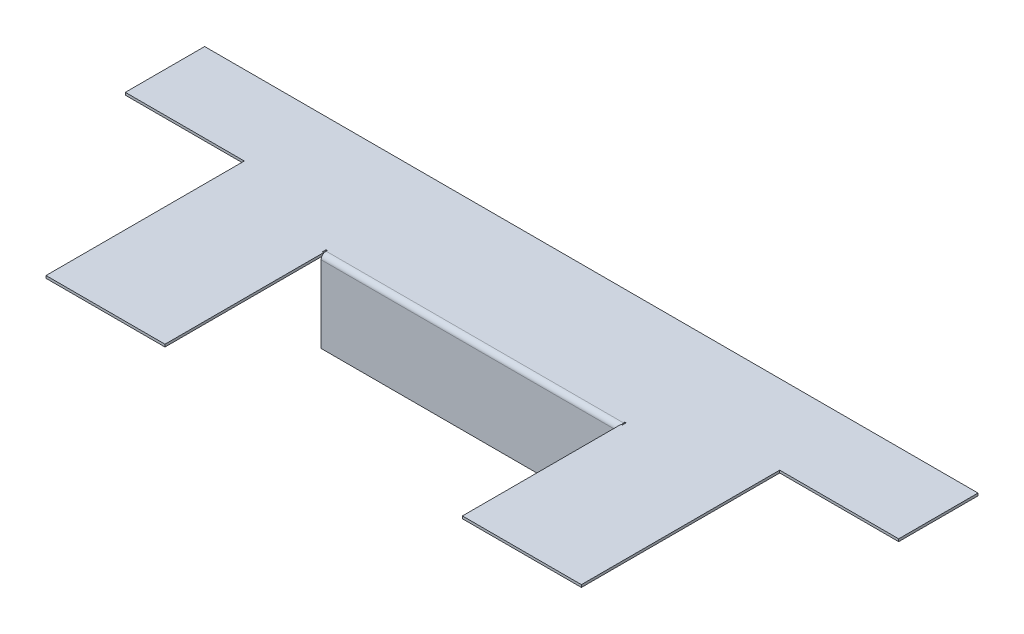
ISO-10303-21;
HEADER;
FILE_DESCRIPTION(('STEP AP214'),'2;1');
FILE_NAME('part.step','',(''),(''),'','','');
FILE_SCHEMA(('AUTOMOTIVE_DESIGN { 1 0 10303 214 1 1 1 1 }'));
ENDSEC;
DATA;
#1=APPLICATION_CONTEXT('core data for automotive mechanical design processes');
#2=APPLICATION_PROTOCOL_DEFINITION('international standard','automotive_design',2000,#1);
#3=PRODUCT_CONTEXT('',#1,'mechanical');
#4=PRODUCT('Part','Part','',(#3));
#5=PRODUCT_RELATED_PRODUCT_CATEGORY('part','',(#4));
#6=PRODUCT_DEFINITION_FORMATION('','',#4);
#7=PRODUCT_DEFINITION_CONTEXT('part definition',#1,'design');
#8=PRODUCT_DEFINITION('design','',#6,#7);
#9=PRODUCT_DEFINITION_SHAPE('','',#8);
#10=(LENGTH_UNIT() NAMED_UNIT(*) SI_UNIT(.MILLI.,.METRE.));
#11=(NAMED_UNIT(*) PLANE_ANGLE_UNIT() SI_UNIT($,.RADIAN.));
#12=(NAMED_UNIT(*) SI_UNIT($,.STERADIAN.) SOLID_ANGLE_UNIT());
#13=UNCERTAINTY_MEASURE_WITH_UNIT(LENGTH_MEASURE(1.E-05),#10,'distance_accuracy_value','');
#14=(GEOMETRIC_REPRESENTATION_CONTEXT(3) GLOBAL_UNCERTAINTY_ASSIGNED_CONTEXT((#13)) GLOBAL_UNIT_ASSIGNED_CONTEXT((#10,
#11,#12)) REPRESENTATION_CONTEXT('',''));
#15=CARTESIAN_POINT('',(0.,0.,0.));
#16=DIRECTION('',(0.,0.,1.));
#17=DIRECTION('',(1.,0.,0.));
#18=AXIS2_PLACEMENT_3D('',#15,#16,#17);
#19=CARTESIAN_POINT('',(0.,-1.5875,0.));
#20=DIRECTION('',(0.,-1.,0.));
#21=DIRECTION('',(0.,0.,-1.));
#22=AXIS2_PLACEMENT_3D('',#19,#20,#21);
#23=PLANE('',#22);
#24=DIRECTION('',(0.,0.,-1.));
#25=VECTOR('',#24,1.);
#26=CARTESIAN_POINT('',(151.60625,-1.58750000000001,76.2));
#27=LINE('',#26,#25);
#28=CARTESIAN_POINT('',(151.60625,-1.5875,76.2));
#29=VERTEX_POINT('',#28);
#30=CARTESIAN_POINT('',(151.60625,-1.5875,73.81875));
#31=VERTEX_POINT('',#30);
#32=EDGE_CURVE('E53',#29,#31,#27,.T.);
#33=ORIENTED_EDGE('',*,*,#32,.F.);
#34=DIRECTION('',(-1.,0.,0.));
#35=VECTOR('',#34,1.);
#36=CARTESIAN_POINT('',(152.4,-1.5875,76.2));
#37=LINE('',#36,#35);
#38=CARTESIAN_POINT('',(152.4,-1.5875,76.2));
#39=VERTEX_POINT('',#38);
#40=EDGE_CURVE('E265',#39,#29,#37,.T.);
#41=ORIENTED_EDGE('',*,*,#40,.F.);
#42=DIRECTION('',(0.,0.,-1.));
#43=VECTOR('',#42,1.);
#44=CARTESIAN_POINT('',(152.4,-1.5875,76.2));
#45=LINE('',#44,#43);
#46=CARTESIAN_POINT('',(152.4,-1.5875,177.8));
#47=VERTEX_POINT('',#46);
#48=EDGE_CURVE('E316',#47,#39,#45,.T.);
#49=ORIENTED_EDGE('',*,*,#48,.F.);
#50=DIRECTION('',(1.,0.,0.));
#51=VECTOR('',#50,1.);
#52=CARTESIAN_POINT('',(152.4,-1.5875,177.8));
#53=LINE('',#52,#51);
#54=CARTESIAN_POINT('',(76.2,-1.5875,177.8));
#55=VERTEX_POINT('',#54);
#56=EDGE_CURVE('E313',#55,#47,#53,.T.);
#57=ORIENTED_EDGE('',*,*,#56,.F.);
#58=DIRECTION('',(0.,0.,1.));
#59=VECTOR('',#58,1.);
#60=CARTESIAN_POINT('',(76.2,-1.5875,177.8));
#61=LINE('',#60,#59);
#62=CARTESIAN_POINT('',(76.2,-1.5875,50.8));
#63=VERTEX_POINT('',#62);
#64=EDGE_CURVE('E310',#63,#55,#61,.T.);
#65=ORIENTED_EDGE('',*,*,#64,.F.);
#66=DIRECTION('',(1.,0.,0.));
#67=VECTOR('',#66,1.);
#68=CARTESIAN_POINT('',(76.2,-1.5875,50.8));
#69=LINE('',#68,#67);
#70=CARTESIAN_POINT('',(0.,-1.5875,50.8));
#71=VERTEX_POINT('',#70);
#72=EDGE_CURVE('E306',#71,#63,#69,.T.);
#73=ORIENTED_EDGE('',*,*,#72,.F.);
#74=DIRECTION('',(0.,0.,1.));
#75=VECTOR('',#74,1.);
#76=CARTESIAN_POINT('',(0.,-1.5875,50.8));
#77=LINE('',#76,#75);
#78=CARTESIAN_POINT('',(0.,-1.5875,0.));
#79=VERTEX_POINT('',#78);
#80=EDGE_CURVE('E303',#79,#71,#77,.T.);
#81=ORIENTED_EDGE('',*,*,#80,.F.);
#82=DIRECTION('',(-1.,0.,0.));
#83=VECTOR('',#82,1.);
#84=CARTESIAN_POINT('',(0.,-1.5875,0.));
#85=LINE('',#84,#83);
#86=CARTESIAN_POINT('',(495.3,-1.5875,0.));
#87=VERTEX_POINT('',#86);
#88=EDGE_CURVE('E334',#87,#79,#85,.T.);
#89=ORIENTED_EDGE('',*,*,#88,.F.);
#90=DIRECTION('',(0.,0.,-1.));
#91=VECTOR('',#90,1.);
#92=CARTESIAN_POINT('',(495.3,-1.5875,0.));
#93=LINE('',#92,#91);
#94=CARTESIAN_POINT('',(495.3,-1.5875,50.8));
#95=VERTEX_POINT('',#94);
#96=EDGE_CURVE('E331',#95,#87,#93,.T.);
#97=ORIENTED_EDGE('',*,*,#96,.F.);
#98=DIRECTION('',(1.,0.,0.));
#99=VECTOR('',#98,1.);
#100=CARTESIAN_POINT('',(495.3,-1.5875,50.8));
#101=LINE('',#100,#99);
#102=CARTESIAN_POINT('',(419.1,-1.5875,50.8));
#103=VERTEX_POINT('',#102);
#104=EDGE_CURVE('E328',#103,#95,#101,.T.);
#105=ORIENTED_EDGE('',*,*,#104,.F.);
#106=DIRECTION('',(0.,0.,-1.));
#107=VECTOR('',#106,1.);
#108=CARTESIAN_POINT('',(419.1,-1.5875,50.8));
#109=LINE('',#108,#107);
#110=CARTESIAN_POINT('',(419.1,-1.5875,177.8));
#111=VERTEX_POINT('',#110);
#112=EDGE_CURVE('E325',#111,#103,#109,.T.);
#113=ORIENTED_EDGE('',*,*,#112,.F.);
#114=DIRECTION('',(1.,0.,0.));
#115=VECTOR('',#114,1.);
#116=CARTESIAN_POINT('',(419.1,-1.5875,177.8));
#117=LINE('',#116,#115);
#118=CARTESIAN_POINT('',(342.9,-1.5875,177.8));
#119=VERTEX_POINT('',#118);
#120=EDGE_CURVE('E322',#119,#111,#117,.T.);
#121=ORIENTED_EDGE('',*,*,#120,.F.);
#122=DIRECTION('',(0.,0.,1.));
#123=VECTOR('',#122,1.);
#124=CARTESIAN_POINT('',(342.9,-1.5875,177.8));
#125=LINE('',#124,#123);
#126=CARTESIAN_POINT('',(342.9,-1.5875,76.2));
#127=VERTEX_POINT('',#126);
#128=EDGE_CURVE('E319',#127,#119,#125,.T.);
#129=ORIENTED_EDGE('',*,*,#128,.F.);
#130=DIRECTION('',(-1.,0.,0.));
#131=VECTOR('',#130,1.);
#132=CARTESIAN_POINT('',(343.69375,-1.58750000000001,76.2));
#133=LINE('',#132,#131);
#134=CARTESIAN_POINT('',(343.69375,-1.5875,76.2));
#135=VERTEX_POINT('',#134);
#136=EDGE_CURVE('E288',#135,#127,#133,.T.);
#137=ORIENTED_EDGE('',*,*,#136,.F.);
#138=DIRECTION('',(0.,0.,1.));
#139=VECTOR('',#138,1.);
#140=CARTESIAN_POINT('',(343.69375,-1.58750000000001,73.81875));
#141=LINE('',#140,#139);
#142=CARTESIAN_POINT('',(343.69375,-1.5875,73.81875));
#143=VERTEX_POINT('',#142);
#144=EDGE_CURVE('E284',#143,#135,#141,.T.);
#145=ORIENTED_EDGE('',*,*,#144,.F.);
#146=DIRECTION('',(1.,0.,0.));
#147=VECTOR('',#146,1.);
#148=CARTESIAN_POINT('',(342.9,-1.58750000000001,73.81875));
#149=LINE('',#148,#147);
#150=CARTESIAN_POINT('',(342.9,-1.5875,73.81875));
#151=VERTEX_POINT('',#150);
#152=EDGE_CURVE('E280',#151,#143,#149,.T.);
#153=ORIENTED_EDGE('',*,*,#152,.F.);
#154=DIRECTION('',(0.,0.,-1.));
#155=VECTOR('',#154,1.);
#156=CARTESIAN_POINT('',(342.9,-1.58750000000001,74.6125));
#157=LINE('',#156,#155);
#158=CARTESIAN_POINT('',(342.9,-1.5875,74.6125));
#159=VERTEX_POINT('',#158);
#160=EDGE_CURVE('E277',#159,#151,#157,.T.);
#161=ORIENTED_EDGE('',*,*,#160,.F.);
#162=DIRECTION('',(-1.,0.,0.));
#163=VECTOR('',#162,1.);
#164=CARTESIAN_POINT('',(152.4,-1.58750000000001,74.6125));
#165=LINE('',#164,#163);
#166=CARTESIAN_POINT('',(152.4,-1.5875,74.6125));
#167=VERTEX_POINT('',#166);
#168=EDGE_CURVE('E256',#167,#159,#165,.F.);
#169=ORIENTED_EDGE('',*,*,#168,.F.);
#170=DIRECTION('',(0.,0.,1.));
#171=VECTOR('',#170,1.);
#172=CARTESIAN_POINT('',(152.4,-1.58750000000001,73.81875));
#173=LINE('',#172,#171);
#174=CARTESIAN_POINT('',(152.4,-1.5875,73.81875));
#175=VERTEX_POINT('',#174);
#176=EDGE_CURVE('E273',#175,#167,#173,.T.);
#177=ORIENTED_EDGE('',*,*,#176,.F.);
#178=DIRECTION('',(1.,0.,0.));
#179=VECTOR('',#178,1.);
#180=CARTESIAN_POINT('',(151.60625,-1.58750000000001,73.81875));
#181=LINE('',#180,#179);
#182=EDGE_CURVE('E58',#31,#175,#181,.T.);
#183=ORIENTED_EDGE('',*,*,#182,.F.);
#184=EDGE_LOOP('',(#33,#41,#49,#57,#65,#73,#81,#89,#97,#105,#113,#121,#129,#137,#145,#153,#161,
#169,#177,#183));
#185=FACE_BOUND('',#184,.T.);
#186=ADVANCED_FACE('F38',(#185),#23,.T.);
#187=CARTESIAN_POINT('',(0.,0.,0.));
#188=DIRECTION('',(0.,-1.,0.));
#189=DIRECTION('',(0.,0.,-1.));
#190=AXIS2_PLACEMENT_3D('',#187,#188,#189);
#191=PLANE('',#190);
#192=DIRECTION('',(1.,0.,0.));
#193=VECTOR('',#192,1.);
#194=CARTESIAN_POINT('',(0.,0.,76.2));
#195=LINE('',#194,#193);
#196=CARTESIAN_POINT('',(151.60625,0.,76.2));
#197=VERTEX_POINT('',#196);
#198=CARTESIAN_POINT('',(152.4,0.,76.2));
#199=VERTEX_POINT('',#198);
#200=EDGE_CURVE('E11',#197,#199,#195,.T.);
#201=ORIENTED_EDGE('',*,*,#200,.F.);
#202=DIRECTION('',(0.,0.,1.));
#203=VECTOR('',#202,1.);
#204=CARTESIAN_POINT('',(151.60625,0.,0.));
#205=LINE('',#204,#203);
#206=CARTESIAN_POINT('',(151.60625,0.,73.81875));
#207=VERTEX_POINT('',#206);
#208=EDGE_CURVE('E46',#207,#197,#205,.T.);
#209=ORIENTED_EDGE('',*,*,#208,.F.);
#210=DIRECTION('',(-1.,0.,0.));
#211=VECTOR('',#210,1.);
#212=CARTESIAN_POINT('',(0.,0.,73.81875));
#213=LINE('',#212,#211);
#214=CARTESIAN_POINT('',(152.4,0.,73.81875));
#215=VERTEX_POINT('',#214);
#216=EDGE_CURVE('E408',#215,#207,#213,.T.);
#217=ORIENTED_EDGE('',*,*,#216,.F.);
#218=DIRECTION('',(0.,0.,-1.));
#219=VECTOR('',#218,1.);
#220=CARTESIAN_POINT('',(152.4,0.,0.));
#221=LINE('',#220,#219);
#222=CARTESIAN_POINT('',(152.4,0.,74.6125));
#223=VERTEX_POINT('',#222);
#224=EDGE_CURVE('E405',#223,#215,#221,.T.);
#225=ORIENTED_EDGE('',*,*,#224,.F.);
#226=DIRECTION('',(-1.,0.,0.));
#227=VECTOR('',#226,1.);
#228=CARTESIAN_POINT('',(152.4,0.,74.6125));
#229=LINE('',#228,#227);
#230=CARTESIAN_POINT('',(342.9,0.,74.6125));
#231=VERTEX_POINT('',#230);
#232=EDGE_CURVE('E205',#223,#231,#229,.F.);
#233=ORIENTED_EDGE('',*,*,#232,.T.);
#234=DIRECTION('',(0.,0.,1.));
#235=VECTOR('',#234,1.);
#236=CARTESIAN_POINT('',(342.9,0.,0.));
#237=LINE('',#236,#235);
#238=CARTESIAN_POINT('',(342.9,0.,73.81875));
#239=VERTEX_POINT('',#238);
#240=EDGE_CURVE('E402',#239,#231,#237,.T.);
#241=ORIENTED_EDGE('',*,*,#240,.F.);
#242=DIRECTION('',(-1.,0.,0.));
#243=VECTOR('',#242,1.);
#244=CARTESIAN_POINT('',(0.,0.,73.81875));
#245=LINE('',#244,#243);
#246=CARTESIAN_POINT('',(343.69375,0.,73.81875));
#247=VERTEX_POINT('',#246);
#248=EDGE_CURVE('E399',#247,#239,#245,.T.);
#249=ORIENTED_EDGE('',*,*,#248,.F.);
#250=DIRECTION('',(0.,0.,-1.));
#251=VECTOR('',#250,1.);
#252=CARTESIAN_POINT('',(343.69375,0.,0.));
#253=LINE('',#252,#251);
#254=CARTESIAN_POINT('',(343.69375,0.,76.2));
#255=VERTEX_POINT('',#254);
#256=EDGE_CURVE('E396',#255,#247,#253,.T.);
#257=ORIENTED_EDGE('',*,*,#256,.F.);
#258=DIRECTION('',(1.,0.,0.));
#259=VECTOR('',#258,1.);
#260=CARTESIAN_POINT('',(0.,0.,76.2));
#261=LINE('',#260,#259);
#262=CARTESIAN_POINT('',(342.9,0.,76.2));
#263=VERTEX_POINT('',#262);
#264=EDGE_CURVE('E371',#263,#255,#261,.T.);
#265=ORIENTED_EDGE('',*,*,#264,.F.);
#266=DIRECTION('',(0.,0.,1.));
#267=VECTOR('',#266,1.);
#268=CARTESIAN_POINT('',(342.9,0.,177.8));
#269=LINE('',#268,#267);
#270=CARTESIAN_POINT('',(342.9,0.,177.8));
#271=VERTEX_POINT('',#270);
#272=EDGE_CURVE('E352',#263,#271,#269,.T.);
#273=ORIENTED_EDGE('',*,*,#272,.T.);
#274=DIRECTION('',(1.,0.,0.));
#275=VECTOR('',#274,1.);
#276=CARTESIAN_POINT('',(419.1,0.,177.8));
#277=LINE('',#276,#275);
#278=CARTESIAN_POINT('',(419.1,0.,177.8));
#279=VERTEX_POINT('',#278);
#280=EDGE_CURVE('E355',#271,#279,#277,.T.);
#281=ORIENTED_EDGE('',*,*,#280,.T.);
#282=DIRECTION('',(0.,0.,-1.));
#283=VECTOR('',#282,1.);
#284=CARTESIAN_POINT('',(419.1,0.,50.8));
#285=LINE('',#284,#283);
#286=CARTESIAN_POINT('',(419.1,0.,50.8));
#287=VERTEX_POINT('',#286);
#288=EDGE_CURVE('E358',#279,#287,#285,.T.);
#289=ORIENTED_EDGE('',*,*,#288,.T.);
#290=DIRECTION('',(1.,0.,0.));
#291=VECTOR('',#290,1.);
#292=CARTESIAN_POINT('',(495.3,0.,50.8));
#293=LINE('',#292,#291);
#294=CARTESIAN_POINT('',(495.3,0.,50.8));
#295=VERTEX_POINT('',#294);
#296=EDGE_CURVE('E361',#287,#295,#293,.T.);
#297=ORIENTED_EDGE('',*,*,#296,.T.);
#298=DIRECTION('',(0.,0.,-1.));
#299=VECTOR('',#298,1.);
#300=CARTESIAN_POINT('',(495.3,0.,0.));
#301=LINE('',#300,#299);
#302=CARTESIAN_POINT('',(495.3,0.,0.));
#303=VERTEX_POINT('',#302);
#304=EDGE_CURVE('E364',#295,#303,#301,.T.);
#305=ORIENTED_EDGE('',*,*,#304,.T.);
#306=DIRECTION('',(-1.,0.,0.));
#307=VECTOR('',#306,1.);
#308=CARTESIAN_POINT('',(0.,0.,0.));
#309=LINE('',#308,#307);
#310=CARTESIAN_POINT('',(0.,0.,0.));
#311=VERTEX_POINT('',#310);
#312=EDGE_CURVE('E307',#303,#311,#309,.T.);
#313=ORIENTED_EDGE('',*,*,#312,.T.);
#314=DIRECTION('',(0.,0.,1.));
#315=VECTOR('',#314,1.);
#316=CARTESIAN_POINT('',(0.,0.,50.8));
#317=LINE('',#316,#315);
#318=CARTESIAN_POINT('',(0.,0.,50.8));
#319=VERTEX_POINT('',#318);
#320=EDGE_CURVE('E268',#311,#319,#317,.T.);
#321=ORIENTED_EDGE('',*,*,#320,.T.);
#322=DIRECTION('',(1.,0.,0.));
#323=VECTOR('',#322,1.);
#324=CARTESIAN_POINT('',(76.2,0.,50.8));
#325=LINE('',#324,#323);
#326=CARTESIAN_POINT('',(76.2,0.,50.8));
#327=VERTEX_POINT('',#326);
#328=EDGE_CURVE('E340',#319,#327,#325,.T.);
#329=ORIENTED_EDGE('',*,*,#328,.T.);
#330=DIRECTION('',(0.,0.,1.));
#331=VECTOR('',#330,1.);
#332=CARTESIAN_POINT('',(76.2,0.,177.8));
#333=LINE('',#332,#331);
#334=CARTESIAN_POINT('',(76.2,0.,177.8));
#335=VERTEX_POINT('',#334);
#336=EDGE_CURVE('E343',#327,#335,#333,.T.);
#337=ORIENTED_EDGE('',*,*,#336,.T.);
#338=DIRECTION('',(1.,0.,0.));
#339=VECTOR('',#338,1.);
#340=CARTESIAN_POINT('',(152.4,0.,177.8));
#341=LINE('',#340,#339);
#342=CARTESIAN_POINT('',(152.4,0.,177.8));
#343=VERTEX_POINT('',#342);
#344=EDGE_CURVE('E346',#335,#343,#341,.T.);
#345=ORIENTED_EDGE('',*,*,#344,.T.);
#346=DIRECTION('',(0.,0.,-1.));
#347=VECTOR('',#346,1.);
#348=CARTESIAN_POINT('',(152.4,0.,76.2));
#349=LINE('',#348,#347);
#350=EDGE_CURVE('E349',#343,#199,#349,.T.);
#351=ORIENTED_EDGE('',*,*,#350,.T.);
#352=EDGE_LOOP('',(#201,#209,#217,#225,#233,#241,#249,#257,#265,#273,#281,#289,#297,#305,#313,
#321,#329,#337,#345,#351));
#353=FACE_BOUND('',#352,.T.);
#354=ADVANCED_FACE('F498',(#353),#191,.F.);
#355=CARTESIAN_POINT('',(0.,-1.5875,50.8));
#356=DIRECTION('',(-1.,0.,0.));
#357=DIRECTION('',(0.,0.,1.));
#358=AXIS2_PLACEMENT_3D('',#355,#356,#357);
#359=PLANE('',#358);
#360=ORIENTED_EDGE('',*,*,#320,.F.);
#361=DIRECTION('',(0.,1.,0.));
#362=VECTOR('',#361,1.);
#363=CARTESIAN_POINT('',(0.,-1.5875,0.));
#364=LINE('',#363,#362);
#365=EDGE_CURVE('E369',#79,#311,#364,.T.);
#366=ORIENTED_EDGE('',*,*,#365,.F.);
#367=ORIENTED_EDGE('',*,*,#80,.T.);
#368=DIRECTION('',(0.,1.,0.));
#369=VECTOR('',#368,1.);
#370=CARTESIAN_POINT('',(0.,-1.5875,50.8));
#371=LINE('',#370,#369);
#372=EDGE_CURVE('E337',#71,#319,#371,.T.);
#373=ORIENTED_EDGE('',*,*,#372,.T.);
#374=EDGE_LOOP('',(#360,#366,#367,#373));
#375=FACE_BOUND('',#374,.T.);
#376=ADVANCED_FACE('F40',(#375),#359,.T.);
#377=CARTESIAN_POINT('',(0.,-1.5875,0.));
#378=DIRECTION('',(0.,0.,-1.));
#379=DIRECTION('',(-1.,0.,0.));
#380=AXIS2_PLACEMENT_3D('',#377,#378,#379);
#381=PLANE('',#380);
#382=ORIENTED_EDGE('',*,*,#312,.F.);
#383=DIRECTION('',(0.,1.,0.));
#384=VECTOR('',#383,1.);
#385=CARTESIAN_POINT('',(495.3,-1.5875,0.));
#386=LINE('',#385,#384);
#387=EDGE_CURVE('E372',#87,#303,#386,.T.);
#388=ORIENTED_EDGE('',*,*,#387,.F.);
#389=ORIENTED_EDGE('',*,*,#88,.T.);
#390=ORIENTED_EDGE('',*,*,#365,.T.);
#391=EDGE_LOOP('',(#382,#388,#389,#390));
#392=FACE_BOUND('',#391,.T.);
#393=ADVANCED_FACE('F439',(#392),#381,.T.);
#394=CARTESIAN_POINT('',(495.3,-1.5875,0.));
#395=DIRECTION('',(1.,0.,0.));
#396=DIRECTION('',(0.,0.,-1.));
#397=AXIS2_PLACEMENT_3D('',#394,#395,#396);
#398=PLANE('',#397);
#399=ORIENTED_EDGE('',*,*,#304,.F.);
#400=DIRECTION('',(0.,1.,0.));
#401=VECTOR('',#400,1.);
#402=CARTESIAN_POINT('',(495.3,-1.5875,50.8));
#403=LINE('',#402,#401);
#404=EDGE_CURVE('E374',#95,#295,#403,.T.);
#405=ORIENTED_EDGE('',*,*,#404,.F.);
#406=ORIENTED_EDGE('',*,*,#96,.T.);
#407=ORIENTED_EDGE('',*,*,#387,.T.);
#408=EDGE_LOOP('',(#399,#405,#406,#407));
#409=FACE_BOUND('',#408,.T.);
#410=ADVANCED_FACE('F509',(#409),#398,.T.);
#411=CARTESIAN_POINT('',(495.3,-1.5875,50.8));
#412=DIRECTION('',(0.,0.,1.));
#413=DIRECTION('',(1.,0.,0.));
#414=AXIS2_PLACEMENT_3D('',#411,#412,#413);
#415=PLANE('',#414);
#416=ORIENTED_EDGE('',*,*,#296,.F.);
#417=DIRECTION('',(0.,1.,0.));
#418=VECTOR('',#417,1.);
#419=CARTESIAN_POINT('',(419.1,-1.5875,50.8));
#420=LINE('',#419,#418);
#421=EDGE_CURVE('E376',#103,#287,#420,.T.);
#422=ORIENTED_EDGE('',*,*,#421,.F.);
#423=ORIENTED_EDGE('',*,*,#104,.T.);
#424=ORIENTED_EDGE('',*,*,#404,.T.);
#425=EDGE_LOOP('',(#416,#422,#423,#424));
#426=FACE_BOUND('',#425,.T.);
#427=ADVANCED_FACE('F446',(#426),#415,.T.);
#428=CARTESIAN_POINT('',(419.1,-1.5875,50.8));
#429=DIRECTION('',(1.,0.,0.));
#430=DIRECTION('',(0.,0.,-1.));
#431=AXIS2_PLACEMENT_3D('',#428,#429,#430);
#432=PLANE('',#431);
#433=ORIENTED_EDGE('',*,*,#288,.F.);
#434=DIRECTION('',(0.,1.,0.));
#435=VECTOR('',#434,1.);
#436=CARTESIAN_POINT('',(419.1,-1.5875,177.8));
#437=LINE('',#436,#435);
#438=EDGE_CURVE('E378',#111,#279,#437,.T.);
#439=ORIENTED_EDGE('',*,*,#438,.F.);
#440=ORIENTED_EDGE('',*,*,#112,.T.);
#441=ORIENTED_EDGE('',*,*,#421,.T.);
#442=EDGE_LOOP('',(#433,#439,#440,#441));
#443=FACE_BOUND('',#442,.T.);
#444=ADVANCED_FACE('F450',(#443),#432,.T.);
#445=CARTESIAN_POINT('',(419.1,-1.5875,177.8));
#446=DIRECTION('',(0.,0.,1.));
#447=DIRECTION('',(1.,0.,0.));
#448=AXIS2_PLACEMENT_3D('',#445,#446,#447);
#449=PLANE('',#448);
#450=ORIENTED_EDGE('',*,*,#280,.F.);
#451=DIRECTION('',(0.,1.,0.));
#452=VECTOR('',#451,1.);
#453=CARTESIAN_POINT('',(342.9,-1.5875,177.8));
#454=LINE('',#453,#452);
#455=EDGE_CURVE('E380',#119,#271,#454,.T.);
#456=ORIENTED_EDGE('',*,*,#455,.F.);
#457=ORIENTED_EDGE('',*,*,#120,.T.);
#458=ORIENTED_EDGE('',*,*,#438,.T.);
#459=EDGE_LOOP('',(#450,#456,#457,#458));
#460=FACE_BOUND('',#459,.T.);
#461=ADVANCED_FACE('F455',(#460),#449,.T.);
#462=CARTESIAN_POINT('',(342.9,-1.5875,177.8));
#463=DIRECTION('',(-1.,0.,0.));
#464=DIRECTION('',(0.,0.,1.));
#465=AXIS2_PLACEMENT_3D('',#462,#463,#464);
#466=PLANE('',#465);
#467=ORIENTED_EDGE('',*,*,#272,.F.);
#468=DIRECTION('',(0.,1.,0.));
#469=VECTOR('',#468,1.);
#470=CARTESIAN_POINT('',(342.9,-1.5875,76.2));
#471=LINE('',#470,#469);
#472=EDGE_CURVE('E382',#127,#263,#471,.T.);
#473=ORIENTED_EDGE('',*,*,#472,.F.);
#474=ORIENTED_EDGE('',*,*,#128,.T.);
#475=ORIENTED_EDGE('',*,*,#455,.T.);
#476=EDGE_LOOP('',(#467,#473,#474,#475));
#477=FACE_BOUND('',#476,.T.);
#478=ADVANCED_FACE('F458',(#477),#466,.T.);
#479=CARTESIAN_POINT('',(152.4,-1.5875,76.2));
#480=DIRECTION('',(1.,0.,0.));
#481=DIRECTION('',(0.,0.,-1.));
#482=AXIS2_PLACEMENT_3D('',#479,#480,#481);
#483=PLANE('',#482);
#484=ORIENTED_EDGE('',*,*,#350,.F.);
#485=DIRECTION('',(0.,1.,0.));
#486=VECTOR('',#485,1.);
#487=CARTESIAN_POINT('',(152.4,-1.5875,177.8));
#488=LINE('',#487,#486);
#489=EDGE_CURVE('E387',#47,#343,#488,.T.);
#490=ORIENTED_EDGE('',*,*,#489,.F.);
#491=ORIENTED_EDGE('',*,*,#48,.T.);
#492=DIRECTION('',(0.,1.,0.));
#493=VECTOR('',#492,1.);
#494=CARTESIAN_POINT('',(152.4,-1.5875,76.2));
#495=LINE('',#494,#493);
#496=EDGE_CURVE('E385',#39,#199,#495,.T.);
#497=ORIENTED_EDGE('',*,*,#496,.T.);
#498=EDGE_LOOP('',(#484,#490,#491,#497));
#499=FACE_BOUND('',#498,.T.);
#500=ADVANCED_FACE('F421',(#499),#483,.T.);
#501=CARTESIAN_POINT('',(152.4,-1.5875,177.8));
#502=DIRECTION('',(0.,0.,1.));
#503=DIRECTION('',(1.,0.,0.));
#504=AXIS2_PLACEMENT_3D('',#501,#502,#503);
#505=PLANE('',#504);
#506=ORIENTED_EDGE('',*,*,#344,.F.);
#507=DIRECTION('',(0.,1.,0.));
#508=VECTOR('',#507,1.);
#509=CARTESIAN_POINT('',(76.2,-1.5875,177.8));
#510=LINE('',#509,#508);
#511=EDGE_CURVE('E389',#55,#335,#510,.T.);
#512=ORIENTED_EDGE('',*,*,#511,.F.);
#513=ORIENTED_EDGE('',*,*,#56,.T.);
#514=ORIENTED_EDGE('',*,*,#489,.T.);
#515=EDGE_LOOP('',(#506,#512,#513,#514));
#516=FACE_BOUND('',#515,.T.);
#517=ADVANCED_FACE('F424',(#516),#505,.T.);
#518=CARTESIAN_POINT('',(76.2,-1.5875,177.8));
#519=DIRECTION('',(-1.,0.,0.));
#520=DIRECTION('',(0.,0.,1.));
#521=AXIS2_PLACEMENT_3D('',#518,#519,#520);
#522=PLANE('',#521);
#523=ORIENTED_EDGE('',*,*,#336,.F.);
#524=DIRECTION('',(0.,1.,0.));
#525=VECTOR('',#524,1.);
#526=CARTESIAN_POINT('',(76.2,-1.5875,50.8));
#527=LINE('',#526,#525);
#528=EDGE_CURVE('E391',#63,#327,#527,.T.);
#529=ORIENTED_EDGE('',*,*,#528,.F.);
#530=ORIENTED_EDGE('',*,*,#64,.T.);
#531=ORIENTED_EDGE('',*,*,#511,.T.);
#532=EDGE_LOOP('',(#523,#529,#530,#531));
#533=FACE_BOUND('',#532,.T.);
#534=ADVANCED_FACE('F429',(#533),#522,.T.);
#535=CARTESIAN_POINT('',(76.2,-1.5875,50.8));
#536=DIRECTION('',(0.,0.,1.));
#537=DIRECTION('',(1.,0.,0.));
#538=AXIS2_PLACEMENT_3D('',#535,#536,#537);
#539=PLANE('',#538);
#540=ORIENTED_EDGE('',*,*,#328,.F.);
#541=ORIENTED_EDGE('',*,*,#372,.F.);
#542=ORIENTED_EDGE('',*,*,#72,.T.);
#543=ORIENTED_EDGE('',*,*,#528,.T.);
#544=EDGE_LOOP('',(#540,#541,#542,#543));
#545=FACE_BOUND('',#544,.T.);
#546=ADVANCED_FACE('F432',(#545),#539,.T.);
#547=CARTESIAN_POINT('',(152.4,-1.5875,76.2));
#548=DIRECTION('',(0.,0.,-1.));
#549=DIRECTION('',(0.,1.,0.));
#550=AXIS2_PLACEMENT_3D('',#547,#548,#549);
#551=PLANE('',#550);
#552=DIRECTION('',(0.,1.,0.));
#553=VECTOR('',#552,1.);
#554=CARTESIAN_POINT('',(151.60625,-1.58750000000001,76.2));
#555=LINE('',#554,#553);
#556=EDGE_CURVE('E270',#29,#197,#555,.T.);
#557=ORIENTED_EDGE('',*,*,#556,.T.);
#558=ORIENTED_EDGE('',*,*,#200,.T.);
#559=ORIENTED_EDGE('',*,*,#496,.F.);
#560=ORIENTED_EDGE('',*,*,#40,.T.);
#561=EDGE_LOOP('',(#557,#558,#559,#560));
#562=FACE_BOUND('',#561,.T.);
#563=ADVANCED_FACE('F415',(#562),#551,.T.);
#564=CARTESIAN_POINT('',(151.60625,-1.58750000000001,76.2));
#565=DIRECTION('',(1.,0.,0.));
#566=DIRECTION('',(0.,0.,-1.));
#567=AXIS2_PLACEMENT_3D('',#564,#565,#566);
#568=PLANE('',#567);
#569=DIRECTION('',(0.,1.,0.));
#570=VECTOR('',#569,1.);
#571=CARTESIAN_POINT('',(151.60625,-1.58750000000001,73.81875));
#572=LINE('',#571,#570);
#573=EDGE_CURVE('E272',#31,#207,#572,.T.);
#574=ORIENTED_EDGE('',*,*,#573,.T.);
#575=ORIENTED_EDGE('',*,*,#208,.T.);
#576=ORIENTED_EDGE('',*,*,#556,.F.);
#577=ORIENTED_EDGE('',*,*,#32,.T.);
#578=EDGE_LOOP('',(#574,#575,#576,#577));
#579=FACE_BOUND('',#578,.T.);
#580=ADVANCED_FACE('F412',(#579),#568,.T.);
#581=CARTESIAN_POINT('',(151.60625,-1.58750000000001,73.81875));
#582=DIRECTION('',(0.,0.,1.));
#583=DIRECTION('',(0.,-1.,0.));
#584=AXIS2_PLACEMENT_3D('',#581,#582,#583);
#585=PLANE('',#584);
#586=DIRECTION('',(0.,1.,0.));
#587=VECTOR('',#586,1.);
#588=CARTESIAN_POINT('',(152.4,-1.58750000000001,73.81875));
#589=LINE('',#588,#587);
#590=EDGE_CURVE('E276',#175,#215,#589,.T.);
#591=ORIENTED_EDGE('',*,*,#590,.T.);
#592=ORIENTED_EDGE('',*,*,#216,.T.);
#593=ORIENTED_EDGE('',*,*,#573,.F.);
#594=ORIENTED_EDGE('',*,*,#182,.T.);
#595=EDGE_LOOP('',(#591,#592,#593,#594));
#596=FACE_BOUND('',#595,.T.);
#597=ADVANCED_FACE('F532',(#596),#585,.T.);
#598=CARTESIAN_POINT('',(152.4,-1.58750000000001,73.81875));
#599=DIRECTION('',(-1.,0.,0.));
#600=DIRECTION('',(0.,0.,1.));
#601=AXIS2_PLACEMENT_3D('',#598,#599,#600);
#602=PLANE('',#601);
#603=DIRECTION('',(0.,1.,0.));
#604=VECTOR('',#603,1.);
#605=CARTESIAN_POINT('',(152.4,-1.58750000000001,74.6125));
#606=LINE('',#605,#604);
#607=EDGE_CURVE('E252',#167,#223,#606,.T.);
#608=ORIENTED_EDGE('',*,*,#607,.T.);
#609=ORIENTED_EDGE('',*,*,#224,.T.);
#610=ORIENTED_EDGE('',*,*,#590,.F.);
#611=ORIENTED_EDGE('',*,*,#176,.T.);
#612=EDGE_LOOP('',(#608,#609,#610,#611));
#613=FACE_BOUND('',#612,.T.);
#614=ADVANCED_FACE('F536',(#613),#602,.T.);
#615=CARTESIAN_POINT('',(342.9,-1.58750000000001,74.6125));
#616=DIRECTION('',(1.,0.,0.));
#617=DIRECTION('',(0.,0.,-1.));
#618=AXIS2_PLACEMENT_3D('',#615,#616,#617);
#619=PLANE('',#618);
#620=DIRECTION('',(0.,1.,0.));
#621=VECTOR('',#620,1.);
#622=CARTESIAN_POINT('',(342.9,-1.58750000000001,73.81875));
#623=LINE('',#622,#621);
#624=EDGE_CURVE('E283',#151,#239,#623,.T.);
#625=ORIENTED_EDGE('',*,*,#624,.T.);
#626=ORIENTED_EDGE('',*,*,#240,.T.);
#627=DIRECTION('',(0.,1.,0.));
#628=VECTOR('',#627,1.);
#629=CARTESIAN_POINT('',(342.9,-1.58750000000001,74.6125));
#630=LINE('',#629,#628);
#631=EDGE_CURVE('E260',#159,#231,#630,.T.);
#632=ORIENTED_EDGE('',*,*,#631,.F.);
#633=ORIENTED_EDGE('',*,*,#160,.T.);
#634=EDGE_LOOP('',(#625,#626,#632,#633));
#635=FACE_BOUND('',#634,.T.);
#636=ADVANCED_FACE('F470',(#635),#619,.T.);
#637=CARTESIAN_POINT('',(342.9,-1.58750000000001,73.81875));
#638=DIRECTION('',(0.,0.,1.));
#639=DIRECTION('',(0.,-1.,0.));
#640=AXIS2_PLACEMENT_3D('',#637,#638,#639);
#641=PLANE('',#640);
#642=DIRECTION('',(0.,1.,0.));
#643=VECTOR('',#642,1.);
#644=CARTESIAN_POINT('',(343.69375,-1.58750000000001,73.81875));
#645=LINE('',#644,#643);
#646=EDGE_CURVE('E287',#143,#247,#645,.T.);
#647=ORIENTED_EDGE('',*,*,#646,.T.);
#648=ORIENTED_EDGE('',*,*,#248,.T.);
#649=ORIENTED_EDGE('',*,*,#624,.F.);
#650=ORIENTED_EDGE('',*,*,#152,.T.);
#651=EDGE_LOOP('',(#647,#648,#649,#650));
#652=FACE_BOUND('',#651,.T.);
#653=ADVANCED_FACE('F468',(#652),#641,.T.);
#654=CARTESIAN_POINT('',(343.69375,-1.58750000000001,73.81875));
#655=DIRECTION('',(-1.,0.,0.));
#656=DIRECTION('',(0.,0.,1.));
#657=AXIS2_PLACEMENT_3D('',#654,#655,#656);
#658=PLANE('',#657);
#659=DIRECTION('',(0.,1.,0.));
#660=VECTOR('',#659,1.);
#661=CARTESIAN_POINT('',(343.69375,-1.58750000000001,76.2));
#662=LINE('',#661,#660);
#663=EDGE_CURVE('E263',#135,#255,#662,.T.);
#664=ORIENTED_EDGE('',*,*,#663,.T.);
#665=ORIENTED_EDGE('',*,*,#256,.T.);
#666=ORIENTED_EDGE('',*,*,#646,.F.);
#667=ORIENTED_EDGE('',*,*,#144,.T.);
#668=EDGE_LOOP('',(#664,#665,#666,#667));
#669=FACE_BOUND('',#668,.T.);
#670=ADVANCED_FACE('F464',(#669),#658,.T.);
#671=CARTESIAN_POINT('',(343.69375,-1.58750000000001,76.2));
#672=DIRECTION('',(0.,0.,-1.));
#673=DIRECTION('',(0.,1.,0.));
#674=AXIS2_PLACEMENT_3D('',#671,#672,#673);
#675=PLANE('',#674);
#676=ORIENTED_EDGE('',*,*,#472,.T.);
#677=ORIENTED_EDGE('',*,*,#264,.T.);
#678=ORIENTED_EDGE('',*,*,#663,.F.);
#679=ORIENTED_EDGE('',*,*,#136,.T.);
#680=EDGE_LOOP('',(#676,#677,#678,#679));
#681=FACE_BOUND('',#680,.T.);
#682=ADVANCED_FACE('F461',(#681),#675,.T.);
#683=CARTESIAN_POINT('',(342.9,-3.175,74.6125));
#684=DIRECTION('',(1.,0.,0.));
#685=DIRECTION('',(0.,0.,-1.));
#686=AXIS2_PLACEMENT_3D('',#683,#684,#685);
#687=PLANE('',#686);
#688=DIRECTION('',(0.,0.,1.));
#689=VECTOR('',#688,1.);
#690=CARTESIAN_POINT('',(342.9,-3.175,76.2));
#691=LINE('',#690,#689);
#692=CARTESIAN_POINT('',(342.9,-3.17499999999999,76.2));
#693=VERTEX_POINT('',#692);
#694=CARTESIAN_POINT('',(342.9,-3.17499999999999,77.7875));
#695=VERTEX_POINT('',#694);
#696=EDGE_CURVE('E478',#693,#695,#691,.T.);
#697=ORIENTED_EDGE('',*,*,#696,.F.);
#698=CARTESIAN_POINT('',(342.9,-3.175,74.6125));
#699=DIRECTION('',(-1.,0.,0.));
#700=DIRECTION('',(0.,0.,1.));
#701=AXIS2_PLACEMENT_3D('',#698,#699,#700);
#702=CIRCLE('',#701,1.58749999999999);
#703=EDGE_CURVE('E208',#159,#693,#702,.F.);
#704=ORIENTED_EDGE('',*,*,#703,.F.);
#705=ORIENTED_EDGE('',*,*,#631,.T.);
#706=CARTESIAN_POINT('',(342.9,-3.175,74.6125));
#707=DIRECTION('',(-1.,0.,0.));
#708=DIRECTION('',(0.,0.,1.));
#709=AXIS2_PLACEMENT_3D('',#706,#707,#708);
#710=CIRCLE('',#709,3.17499999999999);
#711=EDGE_CURVE('E251',#231,#695,#710,.F.);
#712=ORIENTED_EDGE('',*,*,#711,.T.);
#713=EDGE_LOOP('',(#697,#704,#705,#712));
#714=FACE_BOUND('',#713,.T.);
#715=ADVANCED_FACE('F476',(#714),#687,.T.);
#716=CARTESIAN_POINT('',(152.4,-3.175,74.6125));
#717=DIRECTION('',(1.,0.,0.));
#718=DIRECTION('',(0.,0.,-1.));
#719=AXIS2_PLACEMENT_3D('',#716,#717,#718);
#720=PLANE('',#719);
#721=CARTESIAN_POINT('',(152.4,-3.175,74.6125));
#722=DIRECTION('',(-1.,0.,0.));
#723=DIRECTION('',(0.,0.,1.));
#724=AXIS2_PLACEMENT_3D('',#721,#722,#723);
#725=CIRCLE('',#724,1.58749999999999);
#726=CARTESIAN_POINT('',(152.4,-3.17499999999999,76.2));
#727=VERTEX_POINT('',#726);
#728=EDGE_CURVE('E215',#727,#167,#725,.T.);
#729=ORIENTED_EDGE('',*,*,#728,.F.);
#730=DIRECTION('',(0.,0.,1.));
#731=VECTOR('',#730,1.);
#732=CARTESIAN_POINT('',(152.4,-3.175,76.2));
#733=LINE('',#732,#731);
#734=CARTESIAN_POINT('',(152.4,-3.175,77.7875));
#735=VERTEX_POINT('',#734);
#736=EDGE_CURVE('E212',#727,#735,#733,.T.);
#737=ORIENTED_EDGE('',*,*,#736,.T.);
#738=CARTESIAN_POINT('',(152.4,-3.175,74.6125));
#739=DIRECTION('',(-1.,0.,0.));
#740=DIRECTION('',(0.,0.,1.));
#741=AXIS2_PLACEMENT_3D('',#738,#739,#740);
#742=CIRCLE('',#741,3.17499999999999);
#743=EDGE_CURVE('E198',#735,#223,#742,.T.);
#744=ORIENTED_EDGE('',*,*,#743,.T.);
#745=ORIENTED_EDGE('',*,*,#607,.F.);
#746=EDGE_LOOP('',(#729,#737,#744,#745));
#747=FACE_BOUND('',#746,.T.);
#748=ADVANCED_FACE('F213',(#747),#720,.F.);
#749=CARTESIAN_POINT('',(152.4,-3.175,74.6125));
#750=DIRECTION('',(-1.,0.,0.));
#751=DIRECTION('',(0.,0.,1.));
#752=AXIS2_PLACEMENT_3D('',#749,#750,#751);
#753=CYLINDRICAL_SURFACE('',#752,3.17499999999999);
#754=ORIENTED_EDGE('',*,*,#232,.F.);
#755=ORIENTED_EDGE('',*,*,#743,.F.);
#756=DIRECTION('',(1.,0.,0.));
#757=VECTOR('',#756,1.);
#758=CARTESIAN_POINT('',(0.,-3.175,77.7875000000001));
#759=LINE('',#758,#757);
#760=EDGE_CURVE('E203',#735,#695,#759,.T.);
#761=ORIENTED_EDGE('',*,*,#760,.T.);
#762=ORIENTED_EDGE('',*,*,#711,.F.);
#763=EDGE_LOOP('',(#754,#755,#761,#762));
#764=FACE_BOUND('',#763,.T.);
#765=ADVANCED_FACE('F200',(#764),#753,.T.);
#766=CARTESIAN_POINT('',(152.4,-3.175,74.6125));
#767=DIRECTION('',(-1.,0.,0.));
#768=DIRECTION('',(0.,0.,1.));
#769=AXIS2_PLACEMENT_3D('',#766,#767,#768);
#770=CYLINDRICAL_SURFACE('',#769,1.58749999999999);
#771=ORIENTED_EDGE('',*,*,#168,.T.);
#772=ORIENTED_EDGE('',*,*,#703,.T.);
#773=DIRECTION('',(-1.,0.,0.));
#774=VECTOR('',#773,1.);
#775=CARTESIAN_POINT('',(342.9,-3.175,76.2));
#776=LINE('',#775,#774);
#777=EDGE_CURVE('E219',#693,#727,#776,.T.);
#778=ORIENTED_EDGE('',*,*,#777,.T.);
#779=ORIENTED_EDGE('',*,*,#728,.T.);
#780=EDGE_LOOP('',(#771,#772,#778,#779));
#781=FACE_BOUND('',#780,.T.);
#782=ADVANCED_FACE('F474',(#781),#770,.F.);
#783=CARTESIAN_POINT('',(152.4,-52.3875,77.7875000000002));
#784=DIRECTION('',(1.,0.,0.));
#785=DIRECTION('',(0.,1.,0.));
#786=AXIS2_PLACEMENT_3D('',#783,#784,#785);
#787=PLANE('',#786);
#788=ORIENTED_EDGE('',*,*,#736,.F.);
#789=DIRECTION('',(0.,-1.,0.));
#790=VECTOR('',#789,1.);
#791=CARTESIAN_POINT('',(152.4,-52.3875,76.2000000000002));
#792=LINE('',#791,#790);
#793=CARTESIAN_POINT('',(152.4,-52.3875,76.2000000000002));
#794=VERTEX_POINT('',#793);
#795=EDGE_CURVE('E228',#727,#794,#792,.T.);
#796=ORIENTED_EDGE('',*,*,#795,.T.);
#797=DIRECTION('',(0.,0.,-1.));
#798=VECTOR('',#797,1.);
#799=CARTESIAN_POINT('',(152.4,-52.3875,77.7875000000002));
#800=LINE('',#799,#798);
#801=CARTESIAN_POINT('',(152.4,-52.3875,77.7875000000002));
#802=VERTEX_POINT('',#801);
#803=EDGE_CURVE('E233',#802,#794,#800,.T.);
#804=ORIENTED_EDGE('',*,*,#803,.F.);
#805=DIRECTION('',(0.,-1.,0.));
#806=VECTOR('',#805,1.);
#807=CARTESIAN_POINT('',(152.4,-52.3875,77.7875000000002));
#808=LINE('',#807,#806);
#809=EDGE_CURVE('E224',#735,#802,#808,.T.);
#810=ORIENTED_EDGE('',*,*,#809,.F.);
#811=EDGE_LOOP('',(#788,#796,#804,#810));
#812=FACE_BOUND('',#811,.T.);
#813=ADVANCED_FACE('F231',(#812),#787,.F.);
#814=CARTESIAN_POINT('',(342.9,-1.58749999999999,77.7875));
#815=DIRECTION('',(-1.,0.,0.));
#816=DIRECTION('',(0.,0.,1.));
#817=AXIS2_PLACEMENT_3D('',#814,#815,#816);
#818=PLANE('',#817);
#819=ORIENTED_EDGE('',*,*,#696,.T.);
#820=DIRECTION('',(0.,1.,0.));
#821=VECTOR('',#820,1.);
#822=CARTESIAN_POINT('',(342.9,-1.58749999999999,77.7875));
#823=LINE('',#822,#821);
#824=CARTESIAN_POINT('',(342.9,-52.3875,77.7875000000002));
#825=VERTEX_POINT('',#824);
#826=EDGE_CURVE('E227',#825,#695,#823,.T.);
#827=ORIENTED_EDGE('',*,*,#826,.F.);
#828=DIRECTION('',(0.,0.,-1.));
#829=VECTOR('',#828,1.);
#830=CARTESIAN_POINT('',(342.9,-52.3875,77.7875000000002));
#831=LINE('',#830,#829);
#832=CARTESIAN_POINT('',(342.9,-52.3875,76.2000000000002));
#833=VERTEX_POINT('',#832);
#834=EDGE_CURVE('E244',#825,#833,#831,.T.);
#835=ORIENTED_EDGE('',*,*,#834,.T.);
#836=DIRECTION('',(0.,1.,0.));
#837=VECTOR('',#836,1.);
#838=CARTESIAN_POINT('',(342.9,-1.5875,76.2));
#839=LINE('',#838,#837);
#840=EDGE_CURVE('E235',#833,#693,#839,.T.);
#841=ORIENTED_EDGE('',*,*,#840,.T.);
#842=EDGE_LOOP('',(#819,#827,#835,#841));
#843=FACE_BOUND('',#842,.T.);
#844=ADVANCED_FACE('F485',(#843),#818,.F.);
#845=CARTESIAN_POINT('',(0.,2.76159588877796E-13,77.7875000000001));
#846=DIRECTION('',(0.,0.,-1.));
#847=DIRECTION('',(0.,1.,0.));
#848=AXIS2_PLACEMENT_3D('',#845,#846,#847);
#849=PLANE('',#848);
#850=ORIENTED_EDGE('',*,*,#760,.F.);
#851=ORIENTED_EDGE('',*,*,#809,.T.);
#852=DIRECTION('',(1.,0.,0.));
#853=VECTOR('',#852,1.);
#854=CARTESIAN_POINT('',(342.9,-52.3875,77.7875000000002));
#855=LINE('',#854,#853);
#856=EDGE_CURVE('E234',#802,#825,#855,.T.);
#857=ORIENTED_EDGE('',*,*,#856,.T.);
#858=ORIENTED_EDGE('',*,*,#826,.T.);
#859=EDGE_LOOP('',(#850,#851,#857,#858));
#860=FACE_BOUND('',#859,.T.);
#861=ADVANCED_FACE('F223',(#860),#849,.F.);
#862=CARTESIAN_POINT('',(0.,2.70616862252382E-13,76.2));
#863=DIRECTION('',(0.,0.,-1.));
#864=DIRECTION('',(0.,1.,0.));
#865=AXIS2_PLACEMENT_3D('',#862,#863,#864);
#866=PLANE('',#865);
#867=ORIENTED_EDGE('',*,*,#795,.F.);
#868=ORIENTED_EDGE('',*,*,#777,.F.);
#869=ORIENTED_EDGE('',*,*,#840,.F.);
#870=DIRECTION('',(1.,0.,0.));
#871=VECTOR('',#870,1.);
#872=CARTESIAN_POINT('',(342.9,-52.3875,76.2000000000002));
#873=LINE('',#872,#871);
#874=EDGE_CURVE('E239',#794,#833,#873,.T.);
#875=ORIENTED_EDGE('',*,*,#874,.F.);
#876=EDGE_LOOP('',(#867,#868,#869,#875));
#877=FACE_BOUND('',#876,.T.);
#878=ADVANCED_FACE('F483',(#877),#866,.T.);
#879=CARTESIAN_POINT('',(342.9,-52.3875,77.7875000000002));
#880=DIRECTION('',(0.,1.,0.));
#881=DIRECTION('',(0.,0.,1.));
#882=AXIS2_PLACEMENT_3D('',#879,#880,#881);
#883=PLANE('',#882);
#884=ORIENTED_EDGE('',*,*,#874,.T.);
#885=ORIENTED_EDGE('',*,*,#834,.F.);
#886=ORIENTED_EDGE('',*,*,#856,.F.);
#887=ORIENTED_EDGE('',*,*,#803,.T.);
#888=EDGE_LOOP('',(#884,#885,#886,#887));
#889=FACE_BOUND('',#888,.T.);
#890=ADVANCED_FACE('F488',(#889),#883,.F.);
#891=CLOSED_SHELL('',(#186,#354,#376,#393,#410,#427,#444,#461,#478,#500,#517,#534,#546,#563,
#580,#597,#614,#636,#653,#670,#682,#715,#748,#765,#782,#813,#844,#861,#878,#890));
#892=MANIFOLD_SOLID_BREP('B2',#891);
#893=ADVANCED_BREP_SHAPE_REPRESENTATION('',(#18,#892),#14);
#894=SHAPE_DEFINITION_REPRESENTATION(#9,#893);
ENDSEC;
END-ISO-10303-21;
